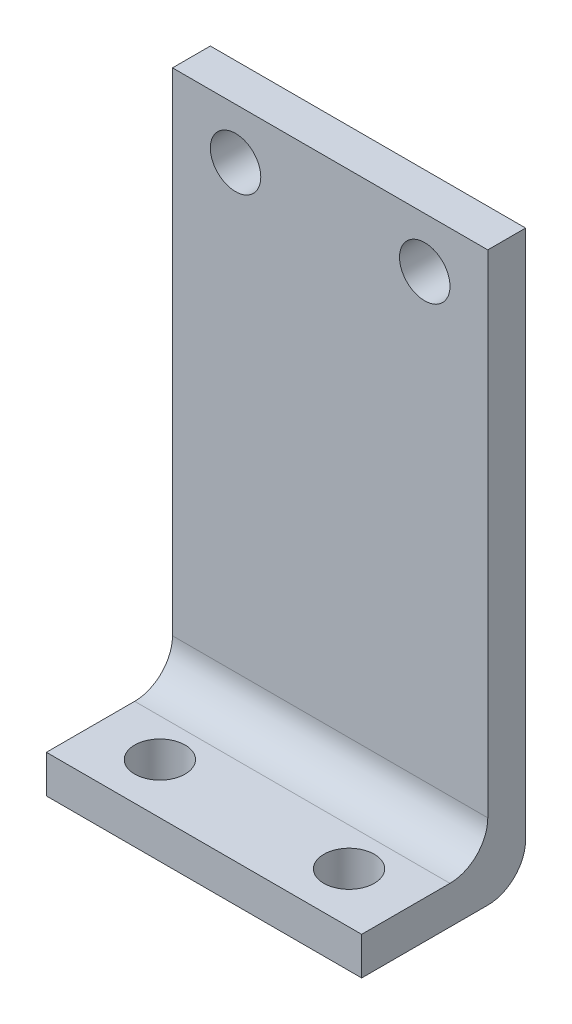
ISO-10303-21;
HEADER;
FILE_DESCRIPTION(('STEP AP214'),'2;1');
FILE_NAME('part.step','',(''),(''),'','','');
FILE_SCHEMA(('AUTOMOTIVE_DESIGN { 1 0 10303 214 1 1 1 1 }'));
ENDSEC;
DATA;
#1=APPLICATION_CONTEXT('core data for automotive mechanical design processes');
#2=APPLICATION_PROTOCOL_DEFINITION('international standard','automotive_design',2000,#1);
#3=PRODUCT_CONTEXT('',#1,'mechanical');
#4=PRODUCT('Part','Part','',(#3));
#5=PRODUCT_RELATED_PRODUCT_CATEGORY('part','',(#4));
#6=PRODUCT_DEFINITION_FORMATION('','',#4);
#7=PRODUCT_DEFINITION_CONTEXT('part definition',#1,'design');
#8=PRODUCT_DEFINITION('design','',#6,#7);
#9=PRODUCT_DEFINITION_SHAPE('','',#8);
#10=(LENGTH_UNIT() NAMED_UNIT(*) SI_UNIT(.MILLI.,.METRE.));
#11=(NAMED_UNIT(*) PLANE_ANGLE_UNIT() SI_UNIT($,.RADIAN.));
#12=(NAMED_UNIT(*) SI_UNIT($,.STERADIAN.) SOLID_ANGLE_UNIT());
#13=UNCERTAINTY_MEASURE_WITH_UNIT(LENGTH_MEASURE(1.E-05),#10,'distance_accuracy_value','');
#14=(GEOMETRIC_REPRESENTATION_CONTEXT(3) GLOBAL_UNCERTAINTY_ASSIGNED_CONTEXT((#13)) GLOBAL_UNIT_ASSIGNED_CONTEXT((#10,
#11,#12)) REPRESENTATION_CONTEXT('',''));
#15=CARTESIAN_POINT('',(0.,0.,0.));
#16=DIRECTION('',(0.,0.,1.));
#17=DIRECTION('',(1.,0.,0.));
#18=AXIS2_PLACEMENT_3D('',#15,#16,#17);
#19=CARTESIAN_POINT('',(25.,0.,-3.));
#20=DIRECTION('',(1.,0.,0.));
#21=DIRECTION('',(0.,0.,-1.));
#22=AXIS2_PLACEMENT_3D('',#19,#20,#21);
#23=PLANE('',#22);
#24=DIRECTION('',(0.,0.,1.));
#25=VECTOR('',#24,1.);
#26=CARTESIAN_POINT('',(25.,0.,-3.));
#27=LINE('',#26,#25);
#28=CARTESIAN_POINT('',(25.,0.,0.));
#29=VERTEX_POINT('',#28);
#30=CARTESIAN_POINT('',(25.,0.,10.));
#31=VERTEX_POINT('',#30);
#32=EDGE_CURVE('E202',#29,#31,#27,.T.);
#33=ORIENTED_EDGE('',*,*,#32,.F.);
#34=CARTESIAN_POINT('',(25.,3.,0.));
#35=DIRECTION('',(1.,0.,0.));
#36=DIRECTION('',(0.,0.,-1.));
#37=AXIS2_PLACEMENT_3D('',#34,#35,#36);
#38=CIRCLE('',#37,3.);
#39=CARTESIAN_POINT('',(25.,3.,-3.));
#40=VERTEX_POINT('',#39);
#41=EDGE_CURVE('E85',#29,#40,#38,.T.);
#42=ORIENTED_EDGE('',*,*,#41,.T.);
#43=DIRECTION('',(0.,1.,0.));
#44=VECTOR('',#43,1.);
#45=CARTESIAN_POINT('',(25.,0.,-3.));
#46=LINE('',#45,#44);
#47=CARTESIAN_POINT('',(25.,45.,-3.));
#48=VERTEX_POINT('',#47);
#49=EDGE_CURVE('E170',#40,#48,#46,.T.);
#50=ORIENTED_EDGE('',*,*,#49,.T.);
#51=DIRECTION('',(0.,0.,1.));
#52=VECTOR('',#51,1.);
#53=CARTESIAN_POINT('',(25.,45.,-3.));
#54=LINE('',#53,#52);
#55=CARTESIAN_POINT('',(25.,45.,0.));
#56=VERTEX_POINT('',#55);
#57=EDGE_CURVE('E185',#48,#56,#54,.T.);
#58=ORIENTED_EDGE('',*,*,#57,.T.);
#59=DIRECTION('',(0.,1.,0.));
#60=VECTOR('',#59,1.);
#61=CARTESIAN_POINT('',(25.,0.,0.));
#62=LINE('',#61,#60);
#63=CARTESIAN_POINT('',(25.,6.,0.));
#64=VERTEX_POINT('',#63);
#65=EDGE_CURVE('E189',#64,#56,#62,.T.);
#66=ORIENTED_EDGE('',*,*,#65,.F.);
#67=CARTESIAN_POINT('',(25.,6.,3.));
#68=DIRECTION('',(1.,0.,0.));
#69=DIRECTION('',(0.,0.,-1.));
#70=AXIS2_PLACEMENT_3D('',#67,#68,#69);
#71=CIRCLE('',#70,3.);
#72=CARTESIAN_POINT('',(25.,3.,3.));
#73=VERTEX_POINT('',#72);
#74=EDGE_CURVE('E13',#64,#73,#71,.F.);
#75=ORIENTED_EDGE('',*,*,#74,.T.);
#76=DIRECTION('',(0.,0.,-1.));
#77=VECTOR('',#76,1.);
#78=CARTESIAN_POINT('',(25.,3.,10.));
#79=LINE('',#78,#77);
#80=CARTESIAN_POINT('',(25.,3.,10.));
#81=VERTEX_POINT('',#80);
#82=EDGE_CURVE('E138',#81,#73,#79,.T.);
#83=ORIENTED_EDGE('',*,*,#82,.F.);
#84=DIRECTION('',(0.,1.,0.));
#85=VECTOR('',#84,1.);
#86=CARTESIAN_POINT('',(25.,0.,10.));
#87=LINE('',#86,#85);
#88=EDGE_CURVE('E146',#31,#81,#87,.T.);
#89=ORIENTED_EDGE('',*,*,#88,.F.);
#90=EDGE_LOOP('',(#33,#42,#50,#58,#66,#75,#83,#89));
#91=FACE_BOUND('',#90,.T.);
#92=ADVANCED_FACE('F59',(#91),#23,.T.);
#93=CARTESIAN_POINT('',(0.,0.,-3.));
#94=DIRECTION('',(0.,-1.,0.));
#95=DIRECTION('',(0.,0.,-1.));
#96=AXIS2_PLACEMENT_3D('',#93,#94,#95);
#97=PLANE('',#96);
#98=CARTESIAN_POINT('',(5.,0.,6.));
#99=DIRECTION('',(0.,-1.,0.));
#100=DIRECTION('',(0.,0.,-1.));
#101=AXIS2_PLACEMENT_3D('',#98,#99,#100);
#102=CIRCLE('',#101,2.);
#103=CARTESIAN_POINT('',(5.,0.,4.));
#104=VERTEX_POINT('',#103);
#105=EDGE_CURVE('E234',#104,#104,#102,.T.);
#106=ORIENTED_EDGE('',*,*,#105,.F.);
#107=EDGE_LOOP('',(#106));
#108=FACE_BOUND('',#107,.T.);
#109=CARTESIAN_POINT('',(20.,0.,6.));
#110=DIRECTION('',(0.,-1.,0.));
#111=DIRECTION('',(0.,0.,-1.));
#112=AXIS2_PLACEMENT_3D('',#109,#110,#111);
#113=CIRCLE('',#112,2.);
#114=CARTESIAN_POINT('',(20.,0.,4.));
#115=VERTEX_POINT('',#114);
#116=EDGE_CURVE('E243',#115,#115,#113,.T.);
#117=ORIENTED_EDGE('',*,*,#116,.F.);
#118=EDGE_LOOP('',(#117));
#119=FACE_BOUND('',#118,.T.);
#120=DIRECTION('',(0.,0.,1.));
#121=VECTOR('',#120,1.);
#122=CARTESIAN_POINT('',(0.,0.,-3.));
#123=LINE('',#122,#121);
#124=CARTESIAN_POINT('',(0.,0.,0.));
#125=VERTEX_POINT('',#124);
#126=CARTESIAN_POINT('',(0.,0.,10.));
#127=VERTEX_POINT('',#126);
#128=EDGE_CURVE('E152',#125,#127,#123,.T.);
#129=ORIENTED_EDGE('',*,*,#128,.F.);
#130=DIRECTION('',(1.,0.,0.));
#131=VECTOR('',#130,1.);
#132=CARTESIAN_POINT('',(25.,0.,0.));
#133=LINE('',#132,#131);
#134=EDGE_CURVE('E219',#125,#29,#133,.T.);
#135=ORIENTED_EDGE('',*,*,#134,.T.);
#136=ORIENTED_EDGE('',*,*,#32,.T.);
#137=DIRECTION('',(1.,0.,0.));
#138=VECTOR('',#137,1.);
#139=CARTESIAN_POINT('',(0.,0.,10.));
#140=LINE('',#139,#138);
#141=EDGE_CURVE('E155',#127,#31,#140,.T.);
#142=ORIENTED_EDGE('',*,*,#141,.F.);
#143=EDGE_LOOP('',(#129,#135,#136,#142));
#144=FACE_BOUND('',#143,.T.);
#145=ADVANCED_FACE('F254',(#108,#119,#144),#97,.T.);
#146=CARTESIAN_POINT('',(0.,0.,-3.));
#147=DIRECTION('',(1.,0.,0.));
#148=DIRECTION('',(0.,0.,-1.));
#149=AXIS2_PLACEMENT_3D('',#146,#147,#148);
#150=PLANE('',#149);
#151=DIRECTION('',(0.,1.,0.));
#152=VECTOR('',#151,1.);
#153=CARTESIAN_POINT('',(0.,0.,-3.));
#154=LINE('',#153,#152);
#155=CARTESIAN_POINT('',(0.,3.,-3.));
#156=VERTEX_POINT('',#155);
#157=CARTESIAN_POINT('',(0.,45.,-3.));
#158=VERTEX_POINT('',#157);
#159=EDGE_CURVE('E178',#156,#158,#154,.T.);
#160=ORIENTED_EDGE('',*,*,#159,.F.);
#161=CARTESIAN_POINT('',(0.,3.,0.));
#162=DIRECTION('',(1.,0.,0.));
#163=DIRECTION('',(0.,0.,-1.));
#164=AXIS2_PLACEMENT_3D('',#161,#162,#163);
#165=CIRCLE('',#164,3.);
#166=EDGE_CURVE('E227',#156,#125,#165,.F.);
#167=ORIENTED_EDGE('',*,*,#166,.T.);
#168=ORIENTED_EDGE('',*,*,#128,.T.);
#169=DIRECTION('',(0.,1.,0.));
#170=VECTOR('',#169,1.);
#171=CARTESIAN_POINT('',(0.,0.,10.));
#172=LINE('',#171,#170);
#173=CARTESIAN_POINT('',(0.,3.,10.));
#174=VERTEX_POINT('',#173);
#175=EDGE_CURVE('E144',#127,#174,#172,.T.);
#176=ORIENTED_EDGE('',*,*,#175,.T.);
#177=DIRECTION('',(0.,0.,-1.));
#178=VECTOR('',#177,1.);
#179=CARTESIAN_POINT('',(0.,3.,10.));
#180=LINE('',#179,#178);
#181=CARTESIAN_POINT('',(0.,3.,3.));
#182=VERTEX_POINT('',#181);
#183=EDGE_CURVE('E127',#174,#182,#180,.T.);
#184=ORIENTED_EDGE('',*,*,#183,.T.);
#185=CARTESIAN_POINT('',(0.,6.,3.));
#186=DIRECTION('',(1.,0.,0.));
#187=DIRECTION('',(0.,0.,-1.));
#188=AXIS2_PLACEMENT_3D('',#185,#186,#187);
#189=CIRCLE('',#188,3.);
#190=CARTESIAN_POINT('',(0.,6.,0.));
#191=VERTEX_POINT('',#190);
#192=EDGE_CURVE('E69',#182,#191,#189,.T.);
#193=ORIENTED_EDGE('',*,*,#192,.T.);
#194=DIRECTION('',(0.,1.,0.));
#195=VECTOR('',#194,1.);
#196=CARTESIAN_POINT('',(0.,0.,0.));
#197=LINE('',#196,#195);
#198=CARTESIAN_POINT('',(0.,45.,0.));
#199=VERTEX_POINT('',#198);
#200=EDGE_CURVE('E196',#191,#199,#197,.T.);
#201=ORIENTED_EDGE('',*,*,#200,.T.);
#202=DIRECTION('',(0.,0.,1.));
#203=VECTOR('',#202,1.);
#204=CARTESIAN_POINT('',(0.,45.,-3.));
#205=LINE('',#204,#203);
#206=EDGE_CURVE('E207',#158,#199,#205,.T.);
#207=ORIENTED_EDGE('',*,*,#206,.F.);
#208=EDGE_LOOP('',(#160,#167,#168,#176,#184,#193,#201,#207));
#209=FACE_BOUND('',#208,.T.);
#210=ADVANCED_FACE('F150',(#209),#150,.F.);
#211=CARTESIAN_POINT('',(0.,45.,-3.));
#212=DIRECTION('',(0.,-1.,0.));
#213=DIRECTION('',(0.,0.,-1.));
#214=AXIS2_PLACEMENT_3D('',#211,#212,#213);
#215=PLANE('',#214);
#216=DIRECTION('',(1.,0.,0.));
#217=VECTOR('',#216,1.);
#218=CARTESIAN_POINT('',(0.,45.,0.));
#219=LINE('',#218,#217);
#220=EDGE_CURVE('E192',#199,#56,#219,.T.);
#221=ORIENTED_EDGE('',*,*,#220,.T.);
#222=ORIENTED_EDGE('',*,*,#57,.F.);
#223=DIRECTION('',(1.,0.,0.));
#224=VECTOR('',#223,1.);
#225=CARTESIAN_POINT('',(0.,45.,-3.));
#226=LINE('',#225,#224);
#227=EDGE_CURVE('E174',#158,#48,#226,.T.);
#228=ORIENTED_EDGE('',*,*,#227,.F.);
#229=ORIENTED_EDGE('',*,*,#206,.T.);
#230=EDGE_LOOP('',(#221,#222,#228,#229));
#231=FACE_BOUND('',#230,.T.);
#232=ADVANCED_FACE('F268',(#231),#215,.F.);
#233=CARTESIAN_POINT('',(5.,41.,-3.));
#234=DIRECTION('',(0.,0.,1.));
#235=DIRECTION('',(1.,0.,0.));
#236=AXIS2_PLACEMENT_3D('',#233,#234,#235);
#237=CYLINDRICAL_SURFACE('',#236,2.);
#238=CARTESIAN_POINT('',(5.,41.,-3.));
#239=DIRECTION('',(0.,0.,1.));
#240=DIRECTION('',(1.,0.,0.));
#241=AXIS2_PLACEMENT_3D('',#238,#239,#240);
#242=CIRCLE('',#241,2.);
#243=CARTESIAN_POINT('',(7.,41.,-3.));
#244=VERTEX_POINT('',#243);
#245=EDGE_CURVE('E166',#244,#244,#242,.T.);
#246=ORIENTED_EDGE('',*,*,#245,.F.);
#247=EDGE_LOOP('',(#246));
#248=FACE_BOUND('',#247,.T.);
#249=CARTESIAN_POINT('',(5.,41.,0.));
#250=DIRECTION('',(0.,0.,1.));
#251=DIRECTION('',(1.,0.,0.));
#252=AXIS2_PLACEMENT_3D('',#249,#250,#251);
#253=CIRCLE('',#252,2.);
#254=CARTESIAN_POINT('',(7.,41.,0.));
#255=VERTEX_POINT('',#254);
#256=EDGE_CURVE('E137',#255,#255,#253,.T.);
#257=ORIENTED_EDGE('',*,*,#256,.T.);
#258=EDGE_LOOP('',(#257));
#259=FACE_BOUND('',#258,.T.);
#260=ADVANCED_FACE('F287',(#248,#259),#237,.F.);
#261=CARTESIAN_POINT('',(20.,41.,-3.));
#262=DIRECTION('',(0.,0.,1.));
#263=DIRECTION('',(1.,0.,0.));
#264=AXIS2_PLACEMENT_3D('',#261,#262,#263);
#265=CYLINDRICAL_SURFACE('',#264,2.);
#266=CARTESIAN_POINT('',(20.,41.,-3.));
#267=DIRECTION('',(0.,0.,1.));
#268=DIRECTION('',(1.,0.,0.));
#269=AXIS2_PLACEMENT_3D('',#266,#267,#268);
#270=CIRCLE('',#269,2.);
#271=CARTESIAN_POINT('',(22.,41.,-3.));
#272=VERTEX_POINT('',#271);
#273=EDGE_CURVE('E181',#272,#272,#270,.T.);
#274=ORIENTED_EDGE('',*,*,#273,.F.);
#275=EDGE_LOOP('',(#274));
#276=FACE_BOUND('',#275,.T.);
#277=CARTESIAN_POINT('',(20.,41.,0.));
#278=DIRECTION('',(0.,0.,1.));
#279=DIRECTION('',(1.,0.,0.));
#280=AXIS2_PLACEMENT_3D('',#277,#278,#279);
#281=CIRCLE('',#280,2.);
#282=CARTESIAN_POINT('',(22.,41.,0.));
#283=VERTEX_POINT('',#282);
#284=EDGE_CURVE('E171',#283,#283,#281,.T.);
#285=ORIENTED_EDGE('',*,*,#284,.T.);
#286=EDGE_LOOP('',(#285));
#287=FACE_BOUND('',#286,.T.);
#288=ADVANCED_FACE('F285',(#276,#287),#265,.F.);
#289=CARTESIAN_POINT('',(0.,0.,-3.));
#290=DIRECTION('',(0.,0.,1.));
#291=DIRECTION('',(1.,0.,0.));
#292=AXIS2_PLACEMENT_3D('',#289,#290,#291);
#293=PLANE('',#292);
#294=ORIENTED_EDGE('',*,*,#245,.T.);
#295=EDGE_LOOP('',(#294));
#296=FACE_BOUND('',#295,.T.);
#297=ORIENTED_EDGE('',*,*,#49,.F.);
#298=DIRECTION('',(1.,0.,0.));
#299=VECTOR('',#298,1.);
#300=CARTESIAN_POINT('',(0.,3.,-3.));
#301=LINE('',#300,#299);
#302=EDGE_CURVE('E77',#40,#156,#301,.F.);
#303=ORIENTED_EDGE('',*,*,#302,.T.);
#304=ORIENTED_EDGE('',*,*,#159,.T.);
#305=ORIENTED_EDGE('',*,*,#227,.T.);
#306=EDGE_LOOP('',(#297,#303,#304,#305));
#307=FACE_BOUND('',#306,.T.);
#308=ORIENTED_EDGE('',*,*,#273,.T.);
#309=EDGE_LOOP('',(#308));
#310=FACE_BOUND('',#309,.T.);
#311=ADVANCED_FACE('F264',(#296,#307,#310),#293,.F.);
#312=CARTESIAN_POINT('',(0.,0.,0.));
#313=DIRECTION('',(0.,0.,1.));
#314=DIRECTION('',(1.,0.,0.));
#315=AXIS2_PLACEMENT_3D('',#312,#313,#314);
#316=PLANE('',#315);
#317=ORIENTED_EDGE('',*,*,#200,.F.);
#318=DIRECTION('',(-1.,0.,0.));
#319=VECTOR('',#318,1.);
#320=CARTESIAN_POINT('',(25.,6.,0.));
#321=LINE('',#320,#319);
#322=EDGE_CURVE('E216',#191,#64,#321,.F.);
#323=ORIENTED_EDGE('',*,*,#322,.T.);
#324=ORIENTED_EDGE('',*,*,#65,.T.);
#325=ORIENTED_EDGE('',*,*,#220,.F.);
#326=EDGE_LOOP('',(#317,#323,#324,#325));
#327=FACE_BOUND('',#326,.T.);
#328=ORIENTED_EDGE('',*,*,#256,.F.);
#329=EDGE_LOOP('',(#328));
#330=FACE_BOUND('',#329,.T.);
#331=ORIENTED_EDGE('',*,*,#284,.F.);
#332=EDGE_LOOP('',(#331));
#333=FACE_BOUND('',#332,.T.);
#334=ADVANCED_FACE('F277',(#327,#330,#333),#316,.T.);
#335=CARTESIAN_POINT('',(0.,3.,10.));
#336=DIRECTION('',(0.,1.,0.));
#337=DIRECTION('',(0.,0.,1.));
#338=AXIS2_PLACEMENT_3D('',#335,#336,#337);
#339=PLANE('',#338);
#340=CARTESIAN_POINT('',(5.,3.00000000000001,6.));
#341=DIRECTION('',(0.,1.,0.));
#342=DIRECTION('',(0.,0.,1.));
#343=AXIS2_PLACEMENT_3D('',#340,#341,#342);
#344=CIRCLE('',#343,2.);
#345=CARTESIAN_POINT('',(5.,3.00000000000001,8.));
#346=VERTEX_POINT('',#345);
#347=EDGE_CURVE('E63',#346,#346,#344,.T.);
#348=ORIENTED_EDGE('',*,*,#347,.F.);
#349=EDGE_LOOP('',(#348));
#350=FACE_BOUND('',#349,.T.);
#351=CARTESIAN_POINT('',(20.,3.00000000000001,6.));
#352=DIRECTION('',(0.,1.,0.));
#353=DIRECTION('',(0.,0.,1.));
#354=AXIS2_PLACEMENT_3D('',#351,#352,#353);
#355=CIRCLE('',#354,2.);
#356=CARTESIAN_POINT('',(20.,3.00000000000001,8.));
#357=VERTEX_POINT('',#356);
#358=EDGE_CURVE('E231',#357,#357,#355,.T.);
#359=ORIENTED_EDGE('',*,*,#358,.F.);
#360=EDGE_LOOP('',(#359));
#361=FACE_BOUND('',#360,.T.);
#362=ORIENTED_EDGE('',*,*,#82,.T.);
#363=DIRECTION('',(-1.,0.,0.));
#364=VECTOR('',#363,1.);
#365=CARTESIAN_POINT('',(0.,3.,3.));
#366=LINE('',#365,#364);
#367=EDGE_CURVE('E133',#73,#182,#366,.T.);
#368=ORIENTED_EDGE('',*,*,#367,.T.);
#369=ORIENTED_EDGE('',*,*,#183,.F.);
#370=DIRECTION('',(1.,0.,0.));
#371=VECTOR('',#370,1.);
#372=CARTESIAN_POINT('',(0.,3.,10.));
#373=LINE('',#372,#371);
#374=EDGE_CURVE('E131',#174,#81,#373,.T.);
#375=ORIENTED_EDGE('',*,*,#374,.T.);
#376=EDGE_LOOP('',(#362,#368,#369,#375));
#377=FACE_BOUND('',#376,.T.);
#378=ADVANCED_FACE('F130',(#350,#361,#377),#339,.T.);
#379=CARTESIAN_POINT('',(0.,0.,10.));
#380=DIRECTION('',(0.,0.,1.));
#381=DIRECTION('',(1.,0.,0.));
#382=AXIS2_PLACEMENT_3D('',#379,#380,#381);
#383=PLANE('',#382);
#384=ORIENTED_EDGE('',*,*,#374,.F.);
#385=ORIENTED_EDGE('',*,*,#175,.F.);
#386=ORIENTED_EDGE('',*,*,#141,.T.);
#387=ORIENTED_EDGE('',*,*,#88,.T.);
#388=EDGE_LOOP('',(#384,#385,#386,#387));
#389=FACE_BOUND('',#388,.T.);
#390=ADVANCED_FACE('F142',(#389),#383,.T.);
#391=CARTESIAN_POINT('',(0.,6.,3.));
#392=DIRECTION('',(1.,0.,0.));
#393=DIRECTION('',(0.,0.,-1.));
#394=AXIS2_PLACEMENT_3D('',#391,#392,#393);
#395=CYLINDRICAL_SURFACE('',#394,3.);
#396=ORIENTED_EDGE('',*,*,#74,.F.);
#397=ORIENTED_EDGE('',*,*,#322,.F.);
#398=ORIENTED_EDGE('',*,*,#192,.F.);
#399=ORIENTED_EDGE('',*,*,#367,.F.);
#400=EDGE_LOOP('',(#396,#397,#398,#399));
#401=FACE_BOUND('',#400,.T.);
#402=ADVANCED_FACE('F275',(#401),#395,.F.);
#403=CARTESIAN_POINT('',(0.,3.,0.));
#404=DIRECTION('',(-1.,0.,0.));
#405=DIRECTION('',(0.,0.,1.));
#406=AXIS2_PLACEMENT_3D('',#403,#404,#405);
#407=CYLINDRICAL_SURFACE('',#406,3.);
#408=ORIENTED_EDGE('',*,*,#166,.F.);
#409=ORIENTED_EDGE('',*,*,#302,.F.);
#410=ORIENTED_EDGE('',*,*,#41,.F.);
#411=ORIENTED_EDGE('',*,*,#134,.F.);
#412=EDGE_LOOP('',(#408,#409,#410,#411));
#413=FACE_BOUND('',#412,.T.);
#414=ADVANCED_FACE('F61',(#413),#407,.T.);
#415=CARTESIAN_POINT('',(20.,45.,6.));
#416=DIRECTION('',(0.,-1.,0.));
#417=DIRECTION('',(0.,0.,-1.));
#418=AXIS2_PLACEMENT_3D('',#415,#416,#417);
#419=CYLINDRICAL_SURFACE('',#418,2.);
#420=ORIENTED_EDGE('',*,*,#358,.T.);
#421=EDGE_LOOP('',(#420));
#422=FACE_BOUND('',#421,.T.);
#423=ORIENTED_EDGE('',*,*,#116,.T.);
#424=EDGE_LOOP('',(#423));
#425=FACE_BOUND('',#424,.T.);
#426=ADVANCED_FACE('F252',(#422,#425),#419,.F.);
#427=CARTESIAN_POINT('',(5.,45.,6.));
#428=DIRECTION('',(0.,-1.,0.));
#429=DIRECTION('',(0.,0.,-1.));
#430=AXIS2_PLACEMENT_3D('',#427,#428,#429);
#431=CYLINDRICAL_SURFACE('',#430,2.);
#432=ORIENTED_EDGE('',*,*,#347,.T.);
#433=EDGE_LOOP('',(#432));
#434=FACE_BOUND('',#433,.T.);
#435=ORIENTED_EDGE('',*,*,#105,.T.);
#436=EDGE_LOOP('',(#435));
#437=FACE_BOUND('',#436,.T.);
#438=ADVANCED_FACE('F320',(#434,#437),#431,.F.);
#439=CLOSED_SHELL('',(#92,#145,#210,#232,#260,#288,#311,#334,#378,#390,#402,#414,#426,#438));
#440=MANIFOLD_SOLID_BREP('B2',#439);
#441=ADVANCED_BREP_SHAPE_REPRESENTATION('',(#18,#440),#14);
#442=SHAPE_DEFINITION_REPRESENTATION(#9,#441);
ENDSEC;
END-ISO-10303-21;
